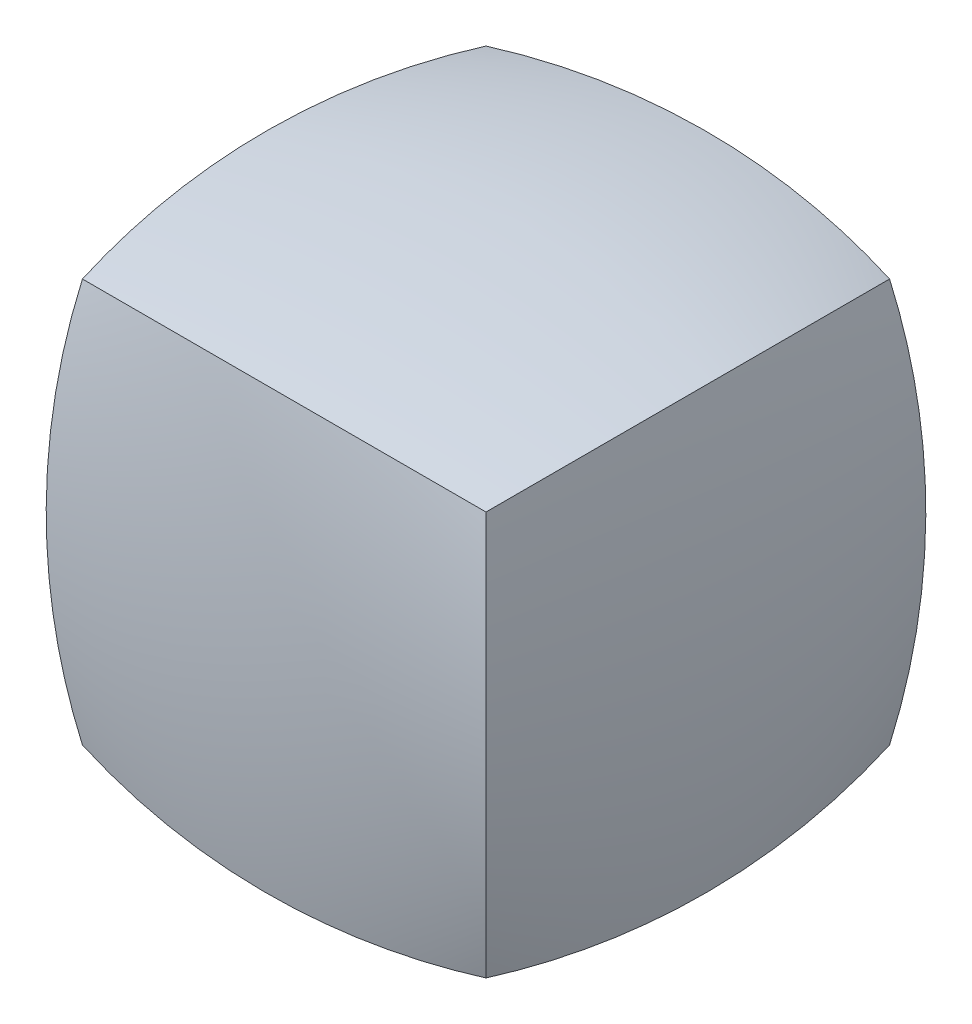
ISO-10303-21;
HEADER;
FILE_DESCRIPTION(('STEP AP214'),'2;1');
FILE_NAME('part.step','',(''),(''),'','','');
FILE_SCHEMA(('AUTOMOTIVE_DESIGN { 1 0 10303 214 1 1 1 1 }'));
ENDSEC;
DATA;
#1=APPLICATION_CONTEXT('core data for automotive mechanical design processes');
#2=APPLICATION_PROTOCOL_DEFINITION('international standard','automotive_design',2000,#1);
#3=PRODUCT_CONTEXT('',#1,'mechanical');
#4=PRODUCT('Part','Part','',(#3));
#5=PRODUCT_RELATED_PRODUCT_CATEGORY('part','',(#4));
#6=PRODUCT_DEFINITION_FORMATION('','',#4);
#7=PRODUCT_DEFINITION_CONTEXT('part definition',#1,'design');
#8=PRODUCT_DEFINITION('design','',#6,#7);
#9=PRODUCT_DEFINITION_SHAPE('','',#8);
#10=(LENGTH_UNIT() NAMED_UNIT(*) SI_UNIT(.MILLI.,.METRE.));
#11=(NAMED_UNIT(*) PLANE_ANGLE_UNIT() SI_UNIT($,.RADIAN.));
#12=(NAMED_UNIT(*) SI_UNIT($,.STERADIAN.) SOLID_ANGLE_UNIT());
#13=UNCERTAINTY_MEASURE_WITH_UNIT(LENGTH_MEASURE(1.E-05),#10,'distance_accuracy_value','');
#14=(GEOMETRIC_REPRESENTATION_CONTEXT(3) GLOBAL_UNCERTAINTY_ASSIGNED_CONTEXT((#13)) GLOBAL_UNIT_ASSIGNED_CONTEXT((#10,
#11,#12)) REPRESENTATION_CONTEXT('',''));
#15=CARTESIAN_POINT('',(0.,0.,0.));
#16=DIRECTION('',(0.,0.,1.));
#17=DIRECTION('',(1.,0.,0.));
#18=AXIS2_PLACEMENT_3D('',#15,#16,#17);
#19=CARTESIAN_POINT('',(-12.7,-12.7000000000001,12.6999999999999));
#20=CARTESIAN_POINT('',(-14.220835289338,-14.220835289338,4.37004205779693));
#21=CARTESIAN_POINT('',(-14.2208352893379,-14.2208352893379,-4.37004205779715));
#22=CARTESIAN_POINT('',(-12.7,-12.6999999999999,-12.7000000000001));
#23=CARTESIAN_POINT('',(-4.37004205779708,-14.2208352893381,14.2208352893378));
#24=CARTESIAN_POINT('',(-4.87698715424304,-15.741670578676,4.87698715424292));
#25=CARTESIAN_POINT('',(-4.87698715424303,-15.7416705786759,-4.87698715424315));
#26=CARTESIAN_POINT('',(-4.37004205779704,-14.2208352893379,-14.220835289338));
#27=CARTESIAN_POINT('',(4.37004205779704,-14.2208352893381,14.2208352893379));
#28=CARTESIAN_POINT('',(4.87698715424304,-15.741670578676,4.87698715424293));
#29=CARTESIAN_POINT('',(4.87698715424304,-15.7416705786759,-4.87698715424314));
#30=CARTESIAN_POINT('',(4.37004205779707,-14.2208352893379,-14.220835289338));
#31=CARTESIAN_POINT('',(12.7,-12.7000000000001,12.6999999999999));
#32=CARTESIAN_POINT('',(14.220835289338,-14.220835289338,4.37004205779697));
#33=CARTESIAN_POINT('',(14.220835289338,-14.2208352893379,-4.37004205779714));
#34=CARTESIAN_POINT('',(12.7,-12.6999999999999,-12.7000000000001));
#35=B_SPLINE_SURFACE_WITH_KNOTS('',3,3,((#19,#20,#21,#22),(#23,#24,#25,#26),(#27,#28,#29,#30),
(#31,#32,#33,#34)),.UNSPECIFIED.,.F.,.F.,.F.,(4,4),(4,4),(0.,1.),(0.,1.),.UNSPECIFIED.);
#36=CARTESIAN_POINT('',(-12.7,-12.7,12.7));
#37=CARTESIAN_POINT('',(-4.37004205779704,-14.220835289338,14.2208352893379));
#38=CARTESIAN_POINT('',(4.37004205779707,-14.220835289338,14.2208352893379));
#39=CARTESIAN_POINT('',(12.7,-12.7,12.7));
#40=B_SPLINE_CURVE_WITH_KNOTS('',3,(#36,#37,#38,#39),.UNSPECIFIED.,.F.,.F.,(4,4),(0.,1.),.UNSPECIFIED.);
#41=CARTESIAN_POINT('',(12.7,-12.7,12.7));
#42=VERTEX_POINT('',#41);
#43=CARTESIAN_POINT('',(-12.7,-12.7,12.7));
#44=VERTEX_POINT('',#43);
#45=EDGE_CURVE('E99',#42,#44,#40,.F.);
#46=CARTESIAN_POINT('',(-12.6999999999999,-12.7000000000001,-12.7));
#47=CARTESIAN_POINT('',(-14.2208352893379,-14.220835289338,-4.37004205779703));
#48=CARTESIAN_POINT('',(-14.2208352893379,-14.220835289338,4.37004205779705));
#49=CARTESIAN_POINT('',(-12.7,-12.7,12.7));
#50=B_SPLINE_CURVE_WITH_KNOTS('',3,(#46,#47,#48,#49),.UNSPECIFIED.,.F.,.F.,(4,4),(0.,1.),.UNSPECIFIED.);
#51=CARTESIAN_POINT('',(-12.7,-12.7,-12.7));
#52=VERTEX_POINT('',#51);
#53=EDGE_CURVE('E61',#44,#52,#50,.F.);
#54=CARTESIAN_POINT('',(-12.7,-12.6999999999999,-12.7000000000001));
#55=CARTESIAN_POINT('',(-4.37004205779708,-14.2208352893378,-14.2208352893381));
#56=CARTESIAN_POINT('',(4.37004205779704,-14.2208352893378,-14.2208352893381));
#57=CARTESIAN_POINT('',(12.7,-12.6999999999999,-12.7000000000001));
#58=B_SPLINE_CURVE_WITH_KNOTS('',3,(#54,#55,#56,#57),.UNSPECIFIED.,.F.,.F.,(4,4),(0.,1.),.UNSPECIFIED.);
#59=CARTESIAN_POINT('',(12.7000000000001,-12.6999999999999,-12.7000000000001));
#60=VERTEX_POINT('',#59);
#61=EDGE_CURVE('E161',#52,#60,#58,.T.);
#62=CARTESIAN_POINT('',(12.7000000000001,-12.6999999999999,-12.7));
#63=CARTESIAN_POINT('',(14.2208352893381,-14.2208352893378,-4.37004205779707));
#64=CARTESIAN_POINT('',(14.2208352893381,-14.2208352893378,4.37004205779704));
#65=CARTESIAN_POINT('',(12.7000000000001,-12.6999999999999,12.7));
#66=B_SPLINE_CURVE_WITH_KNOTS('',3,(#62,#63,#64,#65),.UNSPECIFIED.,.F.,.F.,(4,4),(0.,1.),.UNSPECIFIED.);
#67=EDGE_CURVE('E116',#60,#42,#66,.T.);
#68=ORIENTED_EDGE('',*,*,#45,.T.);
#69=ORIENTED_EDGE('',*,*,#53,.T.);
#70=ORIENTED_EDGE('',*,*,#61,.T.);
#71=ORIENTED_EDGE('',*,*,#67,.T.);
#72=EDGE_LOOP('',(#68,#69,#70,#71));
#73=FACE_BOUND('',#72,.T.);
#74=ADVANCED_FACE('F56',(#73),#35,.F.);
#75=CARTESIAN_POINT('',(-12.6999999999999,-12.7000000000001,-12.7));
#76=CARTESIAN_POINT('',(-14.2208352893379,-14.220835289338,-4.37004205779703));
#77=CARTESIAN_POINT('',(-14.2208352893379,-14.220835289338,4.37004205779705));
#78=CARTESIAN_POINT('',(-12.7,-12.7,12.7));
#79=CARTESIAN_POINT('',(-14.2208352893379,-4.37004205779713,-14.2208352893379));
#80=CARTESIAN_POINT('',(-15.7416705786759,-4.8769871542431,-4.87698715424303));
#81=CARTESIAN_POINT('',(-15.7416705786759,-4.87698715424309,4.87698715424304));
#82=CARTESIAN_POINT('',(-14.2208352893379,-4.37004205779709,14.2208352893379));
#83=CARTESIAN_POINT('',(-14.220835289338,4.37004205779699,-14.220835289338));
#84=CARTESIAN_POINT('',(-15.7416705786759,4.87698715424299,-4.87698715424304));
#85=CARTESIAN_POINT('',(-15.7416705786759,4.87698715424299,4.87698715424303));
#86=CARTESIAN_POINT('',(-14.220835289338,4.37004205779702,14.2208352893379));
#87=CARTESIAN_POINT('',(-12.7,12.6999999999999,-12.7));
#88=CARTESIAN_POINT('',(-14.220835289338,14.2208352893379,-4.37004205779707));
#89=CARTESIAN_POINT('',(-14.220835289338,14.2208352893379,4.37004205779704));
#90=CARTESIAN_POINT('',(-12.7,12.7,12.7));
#91=B_SPLINE_SURFACE_WITH_KNOTS('',3,3,((#75,#76,#77,#78),(#79,#80,#81,#82),(#83,#84,#85,#86),
(#87,#88,#89,#90)),.UNSPECIFIED.,.F.,.F.,.F.,(4,4),(4,4),(0.,1.),(0.,1.),.UNSPECIFIED.);
#92=CARTESIAN_POINT('',(-12.7,-12.6999999999999,-12.7000000000001));
#93=CARTESIAN_POINT('',(-14.220835289338,-4.37004205779688,-14.220835289338));
#94=CARTESIAN_POINT('',(-14.2208352893379,4.3700420577972,-14.2208352893379));
#95=CARTESIAN_POINT('',(-12.7,12.7000000000001,-12.6999999999999));
#96=B_SPLINE_CURVE_WITH_KNOTS('',3,(#92,#93,#94,#95),.UNSPECIFIED.,.F.,.F.,(4,4),(0.,1.),.UNSPECIFIED.);
#97=CARTESIAN_POINT('',(-12.7,12.7,-12.7));
#98=VERTEX_POINT('',#97);
#99=EDGE_CURVE('E107',#98,#52,#96,.F.);
#100=CARTESIAN_POINT('',(-12.7,12.6999999999999,12.7));
#101=CARTESIAN_POINT('',(-14.220835289338,4.37004205779698,14.220835289338));
#102=CARTESIAN_POINT('',(-14.2208352893379,-4.3700420577971,14.2208352893379));
#103=CARTESIAN_POINT('',(-12.7,-12.7,12.7));
#104=B_SPLINE_CURVE_WITH_KNOTS('',3,(#100,#101,#102,#103),.UNSPECIFIED.,.F.,.F.,(4,4),(0.,1.),.UNSPECIFIED.);
#105=CARTESIAN_POINT('',(-12.7,12.7,12.7));
#106=VERTEX_POINT('',#105);
#107=EDGE_CURVE('E105',#44,#106,#104,.F.);
#108=CARTESIAN_POINT('',(-12.7,12.7,-12.7));
#109=CARTESIAN_POINT('',(-14.220835289338,14.220835289338,-4.37004205779703));
#110=CARTESIAN_POINT('',(-14.2208352893379,14.220835289338,4.37004205779705));
#111=CARTESIAN_POINT('',(-12.7,12.7,12.7));
#112=B_SPLINE_CURVE_WITH_KNOTS('',3,(#108,#109,#110,#111),.UNSPECIFIED.,.F.,.F.,(4,4),(0.,1.),.UNSPECIFIED.);
#113=EDGE_CURVE('E79',#106,#98,#112,.F.);
#114=ORIENTED_EDGE('',*,*,#99,.T.);
#115=ORIENTED_EDGE('',*,*,#53,.F.);
#116=ORIENTED_EDGE('',*,*,#107,.T.);
#117=ORIENTED_EDGE('',*,*,#113,.T.);
#118=EDGE_LOOP('',(#114,#115,#116,#117));
#119=FACE_BOUND('',#118,.T.);
#120=ADVANCED_FACE('F104',(#119),#91,.F.);
#121=CARTESIAN_POINT('',(-12.7,12.6999999999999,12.7));
#122=CARTESIAN_POINT('',(-14.220835289338,4.37004205779698,14.220835289338));
#123=CARTESIAN_POINT('',(-14.2208352893379,-4.3700420577971,14.2208352893379));
#124=CARTESIAN_POINT('',(-12.7,-12.7,12.7));
#125=CARTESIAN_POINT('',(-4.37004205779708,14.2208352893379,14.220835289338));
#126=CARTESIAN_POINT('',(-4.87698715424304,4.87698715424297,15.7416705786759));
#127=CARTESIAN_POINT('',(-4.87698715424303,-4.87698715424309,15.7416705786759));
#128=CARTESIAN_POINT('',(-4.37004205779704,-14.220835289338,14.2208352893379));
#129=CARTESIAN_POINT('',(4.37004205779704,14.2208352893379,14.220835289338));
#130=CARTESIAN_POINT('',(4.87698715424304,4.87698715424299,15.7416705786759));
#131=CARTESIAN_POINT('',(4.87698715424304,-4.87698715424309,15.7416705786759));
#132=CARTESIAN_POINT('',(4.37004205779707,-14.220835289338,14.2208352893379));
#133=CARTESIAN_POINT('',(12.7,12.7,12.7));
#134=CARTESIAN_POINT('',(14.220835289338,4.37004205779702,14.220835289338));
#135=CARTESIAN_POINT('',(14.220835289338,-4.37004205779709,14.2208352893379));
#136=CARTESIAN_POINT('',(12.7,-12.7,12.7));
#137=B_SPLINE_SURFACE_WITH_KNOTS('',3,3,((#121,#122,#123,#124),(#125,#126,#127,#128),(#129,#130,
#131,#132),(#133,#134,#135,#136)),.UNSPECIFIED.,.F.,.F.,.F.,(4,4),(4,4),(0.,1.),(0.,1.),.UNSPECIFIED.);
#138=CARTESIAN_POINT('',(-12.7,12.7,12.7));
#139=CARTESIAN_POINT('',(-4.37004205779704,14.220835289338,14.2208352893379));
#140=CARTESIAN_POINT('',(4.37004205779707,14.220835289338,14.2208352893379));
#141=CARTESIAN_POINT('',(12.7,12.7,12.7));
#142=B_SPLINE_CURVE_WITH_KNOTS('',3,(#138,#139,#140,#141),.UNSPECIFIED.,.F.,.F.,(4,4),(0.,1.),.UNSPECIFIED.);
#143=CARTESIAN_POINT('',(12.7,12.7,12.7));
#144=VERTEX_POINT('',#143);
#145=EDGE_CURVE('E113',#144,#106,#142,.F.);
#146=CARTESIAN_POINT('',(12.6999999999999,12.7000000000001,12.7));
#147=CARTESIAN_POINT('',(14.2208352893379,4.37004205779719,14.2208352893379));
#148=CARTESIAN_POINT('',(14.220835289338,-4.37004205779692,14.2208352893379));
#149=CARTESIAN_POINT('',(12.7000000000001,-12.6999999999999,12.7));
#150=B_SPLINE_CURVE_WITH_KNOTS('',3,(#146,#147,#148,#149),.UNSPECIFIED.,.F.,.F.,(4,4),(0.,1.),.UNSPECIFIED.);
#151=EDGE_CURVE('E118',#42,#144,#150,.F.);
#152=ORIENTED_EDGE('',*,*,#145,.T.);
#153=ORIENTED_EDGE('',*,*,#107,.F.);
#154=ORIENTED_EDGE('',*,*,#45,.F.);
#155=ORIENTED_EDGE('',*,*,#151,.T.);
#156=EDGE_LOOP('',(#152,#153,#154,#155));
#157=FACE_BOUND('',#156,.T.);
#158=ADVANCED_FACE('F112',(#157),#137,.F.);
#159=CARTESIAN_POINT('',(12.6999999999999,12.7000000000002,-12.7));
#160=CARTESIAN_POINT('',(14.2208352893378,14.2208352893381,-4.37004205779703));
#161=CARTESIAN_POINT('',(14.2208352893378,14.2208352893381,4.37004205779705));
#162=CARTESIAN_POINT('',(12.6999999999999,12.7000000000001,12.7));
#163=CARTESIAN_POINT('',(14.2208352893379,4.37004205779723,-14.2208352893379));
#164=CARTESIAN_POINT('',(15.7416705786759,4.87698715424321,-4.87698715424303));
#165=CARTESIAN_POINT('',(15.7416705786759,4.8769871542432,4.87698715424304));
#166=CARTESIAN_POINT('',(14.2208352893379,4.37004205779719,14.2208352893379));
#167=CARTESIAN_POINT('',(14.220835289338,-4.37004205779689,-14.220835289338));
#168=CARTESIAN_POINT('',(15.741670578676,-4.87698715424288,-4.87698715424304));
#169=CARTESIAN_POINT('',(15.741670578676,-4.87698715424288,4.87698715424303));
#170=CARTESIAN_POINT('',(14.220835289338,-4.37004205779692,14.2208352893379));
#171=CARTESIAN_POINT('',(12.7000000000001,-12.6999999999999,-12.7));
#172=CARTESIAN_POINT('',(14.2208352893381,-14.2208352893378,-4.37004205779707));
#173=CARTESIAN_POINT('',(14.2208352893381,-14.2208352893378,4.37004205779704));
#174=CARTESIAN_POINT('',(12.7000000000001,-12.6999999999999,12.7));
#175=B_SPLINE_SURFACE_WITH_KNOTS('',3,3,((#159,#160,#161,#162),(#163,#164,#165,#166),(#167,#168,
#169,#170),(#171,#172,#173,#174)),.UNSPECIFIED.,.F.,.F.,.F.,(4,4),(4,4),(0.,1.),(0.,1.),.UNSPECIFIED.);
#176=CARTESIAN_POINT('',(12.7,-12.6999999999999,-12.7000000000001));
#177=CARTESIAN_POINT('',(14.220835289338,-4.37004205779692,-14.220835289338));
#178=CARTESIAN_POINT('',(14.220835289338,4.37004205779719,-14.2208352893379));
#179=CARTESIAN_POINT('',(12.7,12.7000000000001,-12.6999999999999));
#180=B_SPLINE_CURVE_WITH_KNOTS('',3,(#176,#177,#178,#179),.UNSPECIFIED.,.F.,.F.,(4,4),(0.,1.),.UNSPECIFIED.);
#181=CARTESIAN_POINT('',(12.6999999999999,12.7000000000001,-12.7));
#182=VERTEX_POINT('',#181);
#183=EDGE_CURVE('E152',#60,#182,#180,.T.);
#184=CARTESIAN_POINT('',(12.7,12.7,-12.7));
#185=CARTESIAN_POINT('',(14.220835289338,14.220835289338,-4.37004205779707));
#186=CARTESIAN_POINT('',(14.220835289338,14.2208352893379,4.37004205779704));
#187=CARTESIAN_POINT('',(12.7,12.7,12.7));
#188=B_SPLINE_CURVE_WITH_KNOTS('',3,(#184,#185,#186,#187),.UNSPECIFIED.,.F.,.F.,(4,4),(0.,1.),.UNSPECIFIED.);
#189=EDGE_CURVE('E70',#182,#144,#188,.T.);
#190=ORIENTED_EDGE('',*,*,#183,.T.);
#191=ORIENTED_EDGE('',*,*,#189,.T.);
#192=ORIENTED_EDGE('',*,*,#151,.F.);
#193=ORIENTED_EDGE('',*,*,#67,.F.);
#194=EDGE_LOOP('',(#190,#191,#192,#193));
#195=FACE_BOUND('',#194,.T.);
#196=ADVANCED_FACE('F204',(#195),#175,.F.);
#197=CARTESIAN_POINT('',(-12.7,-12.6999999999999,-12.7000000000001));
#198=CARTESIAN_POINT('',(-14.220835289338,-4.37004205779688,-14.220835289338));
#199=CARTESIAN_POINT('',(-14.2208352893379,4.3700420577972,-14.2208352893379));
#200=CARTESIAN_POINT('',(-12.7,12.7000000000001,-12.6999999999999));
#201=CARTESIAN_POINT('',(-4.37004205779708,-14.2208352893378,-14.2208352893381));
#202=CARTESIAN_POINT('',(-4.87698715424304,-4.87698715424286,-15.741670578676));
#203=CARTESIAN_POINT('',(-4.87698715424303,4.8769871542432,-15.7416705786759));
#204=CARTESIAN_POINT('',(-4.37004205779704,14.2208352893381,-14.2208352893378));
#205=CARTESIAN_POINT('',(4.37004205779704,-14.2208352893378,-14.2208352893381));
#206=CARTESIAN_POINT('',(4.87698715424304,-4.87698715424288,-15.741670578676));
#207=CARTESIAN_POINT('',(4.87698715424304,4.8769871542432,-15.7416705786758));
#208=CARTESIAN_POINT('',(4.37004205779707,14.2208352893381,-14.2208352893378));
#209=CARTESIAN_POINT('',(12.7,-12.6999999999999,-12.7000000000001));
#210=CARTESIAN_POINT('',(14.220835289338,-4.37004205779692,-14.220835289338));
#211=CARTESIAN_POINT('',(14.220835289338,4.37004205779719,-14.2208352893379));
#212=CARTESIAN_POINT('',(12.7,12.7000000000001,-12.6999999999999));
#213=B_SPLINE_SURFACE_WITH_KNOTS('',3,3,((#197,#198,#199,#200),(#201,#202,#203,#204),(#205,#206,
#207,#208),(#209,#210,#211,#212)),.UNSPECIFIED.,.F.,.F.,.F.,(4,4),(4,4),(0.,1.),(0.,1.),.UNSPECIFIED.);
#214=CARTESIAN_POINT('',(-12.7,12.7,-12.7));
#215=CARTESIAN_POINT('',(-4.37004205779708,14.220835289338,-14.2208352893379));
#216=CARTESIAN_POINT('',(4.37004205779704,14.220835289338,-14.220835289338));
#217=CARTESIAN_POINT('',(12.7,12.7,-12.7));
#218=B_SPLINE_CURVE_WITH_KNOTS('',3,(#214,#215,#216,#217),.UNSPECIFIED.,.F.,.F.,(4,4),(0.,1.),.UNSPECIFIED.);
#219=EDGE_CURVE('E13',#98,#182,#218,.T.);
#220=ORIENTED_EDGE('',*,*,#61,.F.);
#221=ORIENTED_EDGE('',*,*,#99,.F.);
#222=ORIENTED_EDGE('',*,*,#219,.T.);
#223=ORIENTED_EDGE('',*,*,#183,.F.);
#224=EDGE_LOOP('',(#220,#221,#222,#223));
#225=FACE_BOUND('',#224,.T.);
#226=ADVANCED_FACE('F208',(#225),#213,.F.);
#227=CARTESIAN_POINT('',(-12.7,12.7,-12.7));
#228=CARTESIAN_POINT('',(-14.220835289338,14.220835289338,-4.37004205779703));
#229=CARTESIAN_POINT('',(-14.2208352893379,14.220835289338,4.37004205779705));
#230=CARTESIAN_POINT('',(-12.7,12.7,12.7));
#231=CARTESIAN_POINT('',(-4.37004205779708,14.220835289338,-14.2208352893379));
#232=CARTESIAN_POINT('',(-4.87698715424304,15.7416705786759,-4.87698715424303));
#233=CARTESIAN_POINT('',(-4.87698715424303,15.7416705786759,4.87698715424304));
#234=CARTESIAN_POINT('',(-4.37004205779704,14.220835289338,14.2208352893379));
#235=CARTESIAN_POINT('',(4.37004205779704,14.220835289338,-14.220835289338));
#236=CARTESIAN_POINT('',(4.87698715424304,15.7416705786759,-4.87698715424304));
#237=CARTESIAN_POINT('',(4.87698715424304,15.7416705786759,4.87698715424303));
#238=CARTESIAN_POINT('',(4.37004205779707,14.220835289338,14.2208352893379));
#239=CARTESIAN_POINT('',(12.7,12.7,-12.7));
#240=CARTESIAN_POINT('',(14.220835289338,14.220835289338,-4.37004205779707));
#241=CARTESIAN_POINT('',(14.220835289338,14.2208352893379,4.37004205779704));
#242=CARTESIAN_POINT('',(12.7,12.7,12.7));
#243=B_SPLINE_SURFACE_WITH_KNOTS('',3,3,((#227,#228,#229,#230),(#231,#232,#233,#234),(#235,#236,
#237,#238),(#239,#240,#241,#242)),.UNSPECIFIED.,.F.,.F.,.F.,(4,4),(4,4),(0.,1.),(0.,1.),.UNSPECIFIED.);
#244=ORIENTED_EDGE('',*,*,#219,.F.);
#245=ORIENTED_EDGE('',*,*,#113,.F.);
#246=ORIENTED_EDGE('',*,*,#145,.F.);
#247=ORIENTED_EDGE('',*,*,#189,.F.);
#248=EDGE_LOOP('',(#244,#245,#246,#247));
#249=FACE_BOUND('',#248,.T.);
#250=ADVANCED_FACE('F206',(#249),#243,.F.);
#251=CLOSED_SHELL('',(#74,#120,#158,#196,#226,#250));
#252=MANIFOLD_SOLID_BREP('B2',#251);
#253=ADVANCED_BREP_SHAPE_REPRESENTATION('',(#18,#252),#14);
#254=SHAPE_DEFINITION_REPRESENTATION(#9,#253);
ENDSEC;
END-ISO-10303-21;
